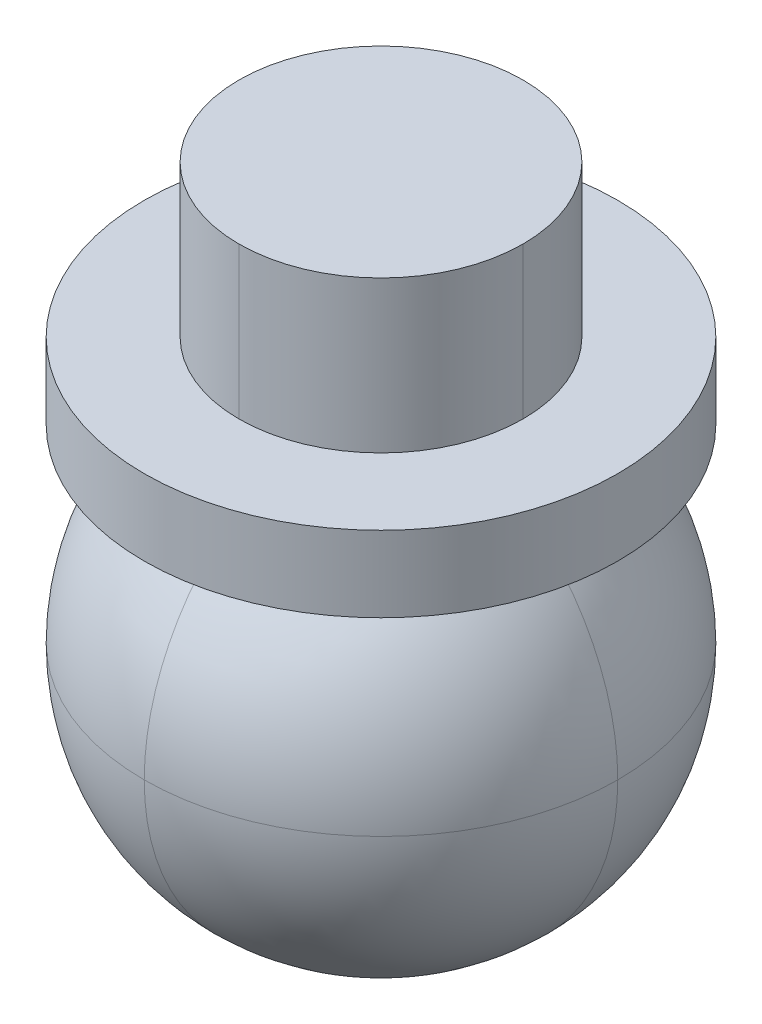
ISO-10303-21;
HEADER;
FILE_DESCRIPTION(('STEP AP214'),'2;1');
FILE_NAME('part.step','',(''),(''),'','','');
FILE_SCHEMA(('AUTOMOTIVE_DESIGN { 1 0 10303 214 1 1 1 1 }'));
ENDSEC;
DATA;
#1=APPLICATION_CONTEXT('core data for automotive mechanical design processes');
#2=APPLICATION_PROTOCOL_DEFINITION('international standard','automotive_design',2000,#1);
#3=PRODUCT_CONTEXT('',#1,'mechanical');
#4=PRODUCT('Part','Part','',(#3));
#5=PRODUCT_RELATED_PRODUCT_CATEGORY('part','',(#4));
#6=PRODUCT_DEFINITION_FORMATION('','',#4);
#7=PRODUCT_DEFINITION_CONTEXT('part definition',#1,'design');
#8=PRODUCT_DEFINITION('design','',#6,#7);
#9=PRODUCT_DEFINITION_SHAPE('','',#8);
#10=(LENGTH_UNIT() NAMED_UNIT(*) SI_UNIT(.MILLI.,.METRE.));
#11=(NAMED_UNIT(*) PLANE_ANGLE_UNIT() SI_UNIT($,.RADIAN.));
#12=(NAMED_UNIT(*) SI_UNIT($,.STERADIAN.) SOLID_ANGLE_UNIT());
#13=UNCERTAINTY_MEASURE_WITH_UNIT(LENGTH_MEASURE(1.E-05),#10,'distance_accuracy_value','');
#14=(GEOMETRIC_REPRESENTATION_CONTEXT(3) GLOBAL_UNCERTAINTY_ASSIGNED_CONTEXT((#13)) GLOBAL_UNIT_ASSIGNED_CONTEXT((#10,
#11,#12)) REPRESENTATION_CONTEXT('',''));
#15=CARTESIAN_POINT('',(0.,0.,0.));
#16=DIRECTION('',(0.,0.,1.));
#17=DIRECTION('',(1.,0.,0.));
#18=AXIS2_PLACEMENT_3D('',#15,#16,#17);
#19=CARTESIAN_POINT('',(-8.,2.5,0.));
#20=DIRECTION('',(0.,-1.,0.));
#21=DIRECTION('',(0.,0.,-1.));
#22=AXIS2_PLACEMENT_3D('',#19,#20,#21);
#23=SPHERICAL_SURFACE('',#22,2.5);
#24=CARTESIAN_POINT('',(-8.00000000000001,4.5,0.));
#25=DIRECTION('',(0.,-1.,0.));
#26=DIRECTION('',(0.,0.,-1.));
#27=AXIS2_PLACEMENT_3D('',#24,#25,#26);
#28=CIRCLE('',#27,1.5);
#29=CARTESIAN_POINT('',(-9.50000000000001,4.5,0.));
#30=VERTEX_POINT('',#29);
#31=CARTESIAN_POINT('',(-8.,4.5,1.5));
#32=VERTEX_POINT('',#31);
#33=EDGE_CURVE('E207',#30,#32,#28,.F.);
#34=ORIENTED_EDGE('',*,*,#33,.F.);
#35=CARTESIAN_POINT('',(-8.,2.5,0.));
#36=DIRECTION('',(0.,0.,-1.));
#37=DIRECTION('',(-1.,0.,0.));
#38=AXIS2_PLACEMENT_3D('',#35,#36,#37);
#39=CIRCLE('',#38,2.5);
#40=CARTESIAN_POINT('',(-10.5,2.5,0.));
#41=VERTEX_POINT('',#40);
#42=EDGE_CURVE('E240',#41,#30,#39,.T.);
#43=ORIENTED_EDGE('',*,*,#42,.F.);
#44=CARTESIAN_POINT('',(-8.,2.5,0.));
#45=DIRECTION('',(0.,-1.,0.));
#46=DIRECTION('',(0.,0.,-1.));
#47=AXIS2_PLACEMENT_3D('',#44,#45,#46);
#48=CIRCLE('',#47,2.5);
#49=CARTESIAN_POINT('',(-8.,2.5,2.5));
#50=VERTEX_POINT('',#49);
#51=EDGE_CURVE('E237',#50,#41,#48,.T.);
#52=ORIENTED_EDGE('',*,*,#51,.F.);
#53=CARTESIAN_POINT('',(-8.,2.5,0.));
#54=DIRECTION('',(1.,0.,0.));
#55=DIRECTION('',(0.,0.,-1.));
#56=AXIS2_PLACEMENT_3D('',#53,#54,#55);
#57=CIRCLE('',#56,2.5);
#58=EDGE_CURVE('E235',#32,#50,#57,.T.);
#59=ORIENTED_EDGE('',*,*,#58,.F.);
#60=EDGE_LOOP('',(#34,#43,#52,#59));
#61=FACE_BOUND('',#60,.T.);
#62=ADVANCED_FACE('F97',(#61),#23,.T.);
#63=CARTESIAN_POINT('',(-8.,2.5,0.));
#64=DIRECTION('',(0.,-1.,0.));
#65=DIRECTION('',(0.,0.,-1.));
#66=AXIS2_PLACEMENT_3D('',#63,#64,#65);
#67=SPHERICAL_SURFACE('',#66,2.5);
#68=CARTESIAN_POINT('',(-8.00000000000001,4.5,0.));
#69=DIRECTION('',(0.,-1.,0.));
#70=DIRECTION('',(0.,0.,-1.));
#71=AXIS2_PLACEMENT_3D('',#68,#69,#70);
#72=CIRCLE('',#71,1.5);
#73=CARTESIAN_POINT('',(-8.00000000000001,4.5,-1.5));
#74=VERTEX_POINT('',#73);
#75=EDGE_CURVE('E173',#74,#30,#72,.F.);
#76=ORIENTED_EDGE('',*,*,#75,.F.);
#77=CARTESIAN_POINT('',(-8.,2.5,0.));
#78=DIRECTION('',(1.,0.,0.));
#79=DIRECTION('',(0.,0.,-1.));
#80=AXIS2_PLACEMENT_3D('',#77,#78,#79);
#81=CIRCLE('',#80,2.5);
#82=CARTESIAN_POINT('',(-8.,2.5,-2.5));
#83=VERTEX_POINT('',#82);
#84=EDGE_CURVE('E231',#83,#74,#81,.T.);
#85=ORIENTED_EDGE('',*,*,#84,.F.);
#86=CARTESIAN_POINT('',(-8.,2.5,0.));
#87=DIRECTION('',(0.,-1.,0.));
#88=DIRECTION('',(0.,0.,-1.));
#89=AXIS2_PLACEMENT_3D('',#86,#87,#88);
#90=CIRCLE('',#89,2.5);
#91=EDGE_CURVE('E228',#41,#83,#90,.T.);
#92=ORIENTED_EDGE('',*,*,#91,.F.);
#93=ORIENTED_EDGE('',*,*,#42,.T.);
#94=EDGE_LOOP('',(#76,#85,#92,#93));
#95=FACE_BOUND('',#94,.T.);
#96=ADVANCED_FACE('F268',(#95),#67,.T.);
#97=CARTESIAN_POINT('',(-8.,2.5,0.));
#98=DIRECTION('',(0.,-1.,0.));
#99=DIRECTION('',(0.,0.,-1.));
#100=AXIS2_PLACEMENT_3D('',#97,#98,#99);
#101=SPHERICAL_SURFACE('',#100,2.5);
#102=CARTESIAN_POINT('',(-8.,2.5,0.));
#103=DIRECTION('',(1.,0.,0.));
#104=DIRECTION('',(0.,0.,-1.));
#105=AXIS2_PLACEMENT_3D('',#102,#103,#104);
#106=CIRCLE('',#105,2.5);
#107=CARTESIAN_POINT('',(-8.,0.,0.));
#108=VERTEX_POINT('',#107);
#109=EDGE_CURVE('E222',#50,#108,#106,.T.);
#110=ORIENTED_EDGE('',*,*,#109,.F.);
#111=ORIENTED_EDGE('',*,*,#51,.T.);
#112=CARTESIAN_POINT('',(-8.,2.5,0.));
#113=DIRECTION('',(0.,0.,-1.));
#114=DIRECTION('',(-1.,0.,0.));
#115=AXIS2_PLACEMENT_3D('',#112,#113,#114);
#116=CIRCLE('',#115,2.5);
#117=EDGE_CURVE('E225',#108,#41,#116,.T.);
#118=ORIENTED_EDGE('',*,*,#117,.F.);
#119=EDGE_LOOP('',(#110,#111,#118));
#120=FACE_BOUND('',#119,.T.);
#121=ADVANCED_FACE('F274',(#120),#101,.T.);
#122=CARTESIAN_POINT('',(-8.,2.5,0.));
#123=DIRECTION('',(0.,-1.,0.));
#124=DIRECTION('',(0.,0.,-1.));
#125=AXIS2_PLACEMENT_3D('',#122,#123,#124);
#126=SPHERICAL_SURFACE('',#125,2.5);
#127=CARTESIAN_POINT('',(-8.00000000000001,4.5,0.));
#128=DIRECTION('',(0.,-1.,0.));
#129=DIRECTION('',(0.,0.,-1.));
#130=AXIS2_PLACEMENT_3D('',#127,#128,#129);
#131=CIRCLE('',#130,1.5);
#132=CARTESIAN_POINT('',(-6.50000000000001,4.5,0.));
#133=VERTEX_POINT('',#132);
#134=EDGE_CURVE('E204',#32,#133,#131,.F.);
#135=ORIENTED_EDGE('',*,*,#134,.F.);
#136=ORIENTED_EDGE('',*,*,#58,.T.);
#137=CARTESIAN_POINT('',(-8.,2.5,0.));
#138=DIRECTION('',(0.,-1.,0.));
#139=DIRECTION('',(0.,0.,-1.));
#140=AXIS2_PLACEMENT_3D('',#137,#138,#139);
#141=CIRCLE('',#140,2.5);
#142=CARTESIAN_POINT('',(-5.5,2.5,0.));
#143=VERTEX_POINT('',#142);
#144=EDGE_CURVE('E219',#143,#50,#141,.T.);
#145=ORIENTED_EDGE('',*,*,#144,.F.);
#146=CARTESIAN_POINT('',(-8.,2.5,0.));
#147=DIRECTION('',(0.,0.,-1.));
#148=DIRECTION('',(-1.,0.,0.));
#149=AXIS2_PLACEMENT_3D('',#146,#147,#148);
#150=CIRCLE('',#149,2.5);
#151=EDGE_CURVE('E233',#133,#143,#150,.T.);
#152=ORIENTED_EDGE('',*,*,#151,.F.);
#153=EDGE_LOOP('',(#135,#136,#145,#152));
#154=FACE_BOUND('',#153,.T.);
#155=ADVANCED_FACE('F294',(#154),#126,.T.);
#156=CARTESIAN_POINT('',(-8.,2.5,0.));
#157=DIRECTION('',(0.,-1.,0.));
#158=DIRECTION('',(0.,0.,-1.));
#159=AXIS2_PLACEMENT_3D('',#156,#157,#158);
#160=SPHERICAL_SURFACE('',#159,2.5);
#161=CARTESIAN_POINT('',(-8.00000000000001,4.5,0.));
#162=DIRECTION('',(0.,-1.,0.));
#163=DIRECTION('',(0.,0.,-1.));
#164=AXIS2_PLACEMENT_3D('',#161,#162,#163);
#165=CIRCLE('',#164,1.5);
#166=EDGE_CURVE('E242',#133,#74,#165,.F.);
#167=ORIENTED_EDGE('',*,*,#166,.F.);
#168=ORIENTED_EDGE('',*,*,#151,.T.);
#169=CARTESIAN_POINT('',(-8.,2.5,0.));
#170=DIRECTION('',(0.,-1.,0.));
#171=DIRECTION('',(0.,0.,-1.));
#172=AXIS2_PLACEMENT_3D('',#169,#170,#171);
#173=CIRCLE('',#172,2.5);
#174=EDGE_CURVE('E216',#83,#143,#173,.T.);
#175=ORIENTED_EDGE('',*,*,#174,.F.);
#176=ORIENTED_EDGE('',*,*,#84,.T.);
#177=EDGE_LOOP('',(#167,#168,#175,#176));
#178=FACE_BOUND('',#177,.T.);
#179=ADVANCED_FACE('F297',(#178),#160,.T.);
#180=CARTESIAN_POINT('',(-8.,2.5,0.));
#181=DIRECTION('',(0.,-1.,0.));
#182=DIRECTION('',(0.,0.,-1.));
#183=AXIS2_PLACEMENT_3D('',#180,#181,#182);
#184=SPHERICAL_SURFACE('',#183,2.5);
#185=ORIENTED_EDGE('',*,*,#117,.T.);
#186=ORIENTED_EDGE('',*,*,#91,.T.);
#187=CARTESIAN_POINT('',(-8.,2.5,0.));
#188=DIRECTION('',(1.,0.,0.));
#189=DIRECTION('',(0.,0.,-1.));
#190=AXIS2_PLACEMENT_3D('',#187,#188,#189);
#191=CIRCLE('',#190,2.5);
#192=EDGE_CURVE('E213',#108,#83,#191,.T.);
#193=ORIENTED_EDGE('',*,*,#192,.F.);
#194=EDGE_LOOP('',(#185,#186,#193));
#195=FACE_BOUND('',#194,.T.);
#196=ADVANCED_FACE('F285',(#195),#184,.T.);
#197=CARTESIAN_POINT('',(-8.,2.5,0.));
#198=DIRECTION('',(0.,-1.,0.));
#199=DIRECTION('',(0.,0.,-1.));
#200=AXIS2_PLACEMENT_3D('',#197,#198,#199);
#201=SPHERICAL_SURFACE('',#200,2.5);
#202=ORIENTED_EDGE('',*,*,#144,.T.);
#203=ORIENTED_EDGE('',*,*,#109,.T.);
#204=CARTESIAN_POINT('',(-8.,2.5,0.));
#205=DIRECTION('',(0.,0.,-1.));
#206=DIRECTION('',(-1.,0.,0.));
#207=AXIS2_PLACEMENT_3D('',#204,#205,#206);
#208=CIRCLE('',#207,2.5);
#209=EDGE_CURVE('E210',#143,#108,#208,.T.);
#210=ORIENTED_EDGE('',*,*,#209,.F.);
#211=EDGE_LOOP('',(#202,#203,#210));
#212=FACE_BOUND('',#211,.T.);
#213=ADVANCED_FACE('F290',(#212),#201,.T.);
#214=CARTESIAN_POINT('',(-8.,2.5,0.));
#215=DIRECTION('',(0.,-1.,0.));
#216=DIRECTION('',(0.,0.,-1.));
#217=AXIS2_PLACEMENT_3D('',#214,#215,#216);
#218=SPHERICAL_SURFACE('',#217,2.5);
#219=ORIENTED_EDGE('',*,*,#192,.T.);
#220=ORIENTED_EDGE('',*,*,#174,.T.);
#221=ORIENTED_EDGE('',*,*,#209,.T.);
#222=EDGE_LOOP('',(#219,#220,#221));
#223=FACE_BOUND('',#222,.T.);
#224=ADVANCED_FACE('F263',(#223),#218,.T.);
#225=CARTESIAN_POINT('',(-8.,4.5,0.));
#226=DIRECTION('',(0.,1.,0.));
#227=DIRECTION('',(0.,0.,1.));
#228=AXIS2_PLACEMENT_3D('',#225,#226,#227);
#229=PLANE('',#228);
#230=ORIENTED_EDGE('',*,*,#134,.T.);
#231=ORIENTED_EDGE('',*,*,#166,.T.);
#232=ORIENTED_EDGE('',*,*,#75,.T.);
#233=ORIENTED_EDGE('',*,*,#33,.T.);
#234=EDGE_LOOP('',(#230,#231,#232,#233));
#235=FACE_BOUND('',#234,.T.);
#236=CARTESIAN_POINT('',(-8.,4.5,0.));
#237=DIRECTION('',(0.,-1.,0.));
#238=DIRECTION('',(0.,0.,-1.));
#239=AXIS2_PLACEMENT_3D('',#236,#237,#238);
#240=CIRCLE('',#239,2.5);
#241=CARTESIAN_POINT('',(-8.,4.5,-2.5));
#242=VERTEX_POINT('',#241);
#243=EDGE_CURVE('E189',#242,#242,#240,.T.);
#244=ORIENTED_EDGE('',*,*,#243,.T.);
#245=EDGE_LOOP('',(#244));
#246=FACE_BOUND('',#245,.T.);
#247=ADVANCED_FACE('F257',(#235,#246),#229,.F.);
#248=CARTESIAN_POINT('',(-8.,0.,0.));
#249=DIRECTION('',(0.,-1.,0.));
#250=DIRECTION('',(0.,0.,-1.));
#251=AXIS2_PLACEMENT_3D('',#248,#249,#250);
#252=CYLINDRICAL_SURFACE('',#251,2.5);
#253=ORIENTED_EDGE('',*,*,#243,.F.);
#254=EDGE_LOOP('',(#253));
#255=FACE_BOUND('',#254,.T.);
#256=CARTESIAN_POINT('',(-8.,5.3,0.));
#257=DIRECTION('',(0.,-1.,0.));
#258=DIRECTION('',(0.,0.,-1.));
#259=AXIS2_PLACEMENT_3D('',#256,#257,#258);
#260=CIRCLE('',#259,2.5);
#261=CARTESIAN_POINT('',(-8.,5.3,-2.5));
#262=VERTEX_POINT('',#261);
#263=EDGE_CURVE('E184',#262,#262,#260,.T.);
#264=ORIENTED_EDGE('',*,*,#263,.T.);
#265=EDGE_LOOP('',(#264));
#266=FACE_BOUND('',#265,.T.);
#267=ADVANCED_FACE('F252',(#255,#266),#252,.T.);
#268=CARTESIAN_POINT('',(-10.5,5.3,0.));
#269=DIRECTION('',(0.,-1.,0.));
#270=DIRECTION('',(0.,0.,-1.));
#271=AXIS2_PLACEMENT_3D('',#268,#269,#270);
#272=PLANE('',#271);
#273=CARTESIAN_POINT('',(-8.00000000000001,5.3,0.));
#274=DIRECTION('',(0.,-1.,0.));
#275=DIRECTION('',(0.,0.,-1.));
#276=AXIS2_PLACEMENT_3D('',#273,#274,#275);
#277=CIRCLE('',#276,1.5);
#278=CARTESIAN_POINT('',(-8.00000000000001,5.3,1.5));
#279=VERTEX_POINT('',#278);
#280=CARTESIAN_POINT('',(-6.50000000000001,5.3,0.));
#281=VERTEX_POINT('',#280);
#282=EDGE_CURVE('E169',#279,#281,#277,.F.);
#283=ORIENTED_EDGE('',*,*,#282,.F.);
#284=CARTESIAN_POINT('',(-8.00000000000001,5.3,0.));
#285=DIRECTION('',(0.,-1.,0.));
#286=DIRECTION('',(0.,0.,-1.));
#287=AXIS2_PLACEMENT_3D('',#284,#285,#286);
#288=CIRCLE('',#287,1.5);
#289=CARTESIAN_POINT('',(-9.50000000000001,5.3,0.));
#290=VERTEX_POINT('',#289);
#291=EDGE_CURVE('E192',#290,#279,#288,.F.);
#292=ORIENTED_EDGE('',*,*,#291,.F.);
#293=CARTESIAN_POINT('',(-8.00000000000001,5.3,0.));
#294=DIRECTION('',(0.,-1.,0.));
#295=DIRECTION('',(0.,0.,-1.));
#296=AXIS2_PLACEMENT_3D('',#293,#294,#295);
#297=CIRCLE('',#296,1.5);
#298=CARTESIAN_POINT('',(-8.00000000000001,5.3,-1.5));
#299=VERTEX_POINT('',#298);
#300=EDGE_CURVE('E104',#299,#290,#297,.F.);
#301=ORIENTED_EDGE('',*,*,#300,.F.);
#302=CARTESIAN_POINT('',(-8.00000000000001,5.3,0.));
#303=DIRECTION('',(0.,-1.,0.));
#304=DIRECTION('',(0.,0.,-1.));
#305=AXIS2_PLACEMENT_3D('',#302,#303,#304);
#306=CIRCLE('',#305,1.5);
#307=EDGE_CURVE('E195',#281,#299,#306,.F.);
#308=ORIENTED_EDGE('',*,*,#307,.F.);
#309=EDGE_LOOP('',(#283,#292,#301,#308));
#310=FACE_BOUND('',#309,.T.);
#311=ORIENTED_EDGE('',*,*,#263,.F.);
#312=EDGE_LOOP('',(#311));
#313=FACE_BOUND('',#312,.T.);
#314=ADVANCED_FACE('F249',(#310,#313),#272,.F.);
#315=CARTESIAN_POINT('',(-8.00000000000001,2.8729861543631,0.));
#316=DIRECTION('',(0.,1.,0.));
#317=DIRECTION('',(0.,0.,1.));
#318=AXIS2_PLACEMENT_3D('',#315,#316,#317);
#319=CYLINDRICAL_SURFACE('',#318,1.5);
#320=CARTESIAN_POINT('',(-8.00000000000001,6.9,0.));
#321=DIRECTION('',(0.,-1.,0.));
#322=DIRECTION('',(0.,0.,-1.));
#323=AXIS2_PLACEMENT_3D('',#320,#321,#322);
#324=CIRCLE('',#323,1.5);
#325=CARTESIAN_POINT('',(-8.00000000000001,6.9,-1.5));
#326=VERTEX_POINT('',#325);
#327=CARTESIAN_POINT('',(-9.50000000000001,6.9,0.));
#328=VERTEX_POINT('',#327);
#329=EDGE_CURVE('E118',#326,#328,#324,.F.);
#330=ORIENTED_EDGE('',*,*,#329,.F.);
#331=DIRECTION('',(0.,1.,0.));
#332=VECTOR('',#331,1.);
#333=CARTESIAN_POINT('',(-8.00000000000001,2.8729861543631,-1.5));
#334=LINE('',#333,#332);
#335=EDGE_CURVE('E179',#326,#299,#334,.F.);
#336=ORIENTED_EDGE('',*,*,#335,.T.);
#337=ORIENTED_EDGE('',*,*,#300,.T.);
#338=DIRECTION('',(0.,-1.,0.));
#339=VECTOR('',#338,1.);
#340=CARTESIAN_POINT('',(-9.50000000000001,2.8729861543631,0.));
#341=LINE('',#340,#339);
#342=EDGE_CURVE('E198',#290,#328,#341,.F.);
#343=ORIENTED_EDGE('',*,*,#342,.T.);
#344=EDGE_LOOP('',(#330,#336,#337,#343));
#345=FACE_BOUND('',#344,.T.);
#346=ADVANCED_FACE('F246',(#345),#319,.T.);
#347=CARTESIAN_POINT('',(-8.00000000000001,0.,0.));
#348=DIRECTION('',(0.,-1.,0.));
#349=DIRECTION('',(0.,0.,-1.));
#350=AXIS2_PLACEMENT_3D('',#347,#348,#349);
#351=CYLINDRICAL_SURFACE('',#350,1.5);
#352=CARTESIAN_POINT('',(-8.00000000000001,6.9,0.));
#353=DIRECTION('',(0.,-1.,0.));
#354=DIRECTION('',(0.,0.,-1.));
#355=AXIS2_PLACEMENT_3D('',#352,#353,#354);
#356=CIRCLE('',#355,1.5);
#357=CARTESIAN_POINT('',(-8.00000000000001,6.9,1.5));
#358=VERTEX_POINT('',#357);
#359=EDGE_CURVE('E111',#328,#358,#356,.F.);
#360=ORIENTED_EDGE('',*,*,#359,.F.);
#361=ORIENTED_EDGE('',*,*,#342,.F.);
#362=ORIENTED_EDGE('',*,*,#291,.T.);
#363=DIRECTION('',(0.,1.,0.));
#364=VECTOR('',#363,1.);
#365=CARTESIAN_POINT('',(-8.00000000000001,0.,1.5));
#366=LINE('',#365,#364);
#367=EDGE_CURVE('E174',#279,#358,#366,.T.);
#368=ORIENTED_EDGE('',*,*,#367,.T.);
#369=EDGE_LOOP('',(#360,#361,#362,#368));
#370=FACE_BOUND('',#369,.T.);
#371=ADVANCED_FACE('F248',(#370),#351,.T.);
#372=CARTESIAN_POINT('',(-8.00000000000001,2.8729861543631,0.));
#373=DIRECTION('',(0.,-1.,0.));
#374=DIRECTION('',(1.,0.,0.));
#375=AXIS2_PLACEMENT_3D('',#372,#373,#374);
#376=CYLINDRICAL_SURFACE('',#375,1.5);
#377=CARTESIAN_POINT('',(-8.00000000000001,6.9,0.));
#378=DIRECTION('',(0.,-1.,0.));
#379=DIRECTION('',(0.,0.,-1.));
#380=AXIS2_PLACEMENT_3D('',#377,#378,#379);
#381=CIRCLE('',#380,1.5);
#382=CARTESIAN_POINT('',(-6.50000000000001,6.9,0.));
#383=VERTEX_POINT('',#382);
#384=EDGE_CURVE('E177',#383,#326,#381,.F.);
#385=ORIENTED_EDGE('',*,*,#384,.F.);
#386=DIRECTION('',(0.,1.,0.));
#387=VECTOR('',#386,1.);
#388=CARTESIAN_POINT('',(-6.50000000000001,2.8729861543631,0.));
#389=LINE('',#388,#387);
#390=EDGE_CURVE('E165',#383,#281,#389,.F.);
#391=ORIENTED_EDGE('',*,*,#390,.T.);
#392=ORIENTED_EDGE('',*,*,#307,.T.);
#393=ORIENTED_EDGE('',*,*,#335,.F.);
#394=EDGE_LOOP('',(#385,#391,#392,#393));
#395=FACE_BOUND('',#394,.T.);
#396=ADVANCED_FACE('F178',(#395),#376,.T.);
#397=CARTESIAN_POINT('',(-8.00000000000001,0.,0.));
#398=DIRECTION('',(0.,1.,0.));
#399=DIRECTION('',(-1.,0.,0.));
#400=AXIS2_PLACEMENT_3D('',#397,#398,#399);
#401=CYLINDRICAL_SURFACE('',#400,1.5);
#402=CARTESIAN_POINT('',(-8.00000000000001,6.9,0.));
#403=DIRECTION('',(0.,-1.,0.));
#404=DIRECTION('',(0.,0.,-1.));
#405=AXIS2_PLACEMENT_3D('',#402,#403,#404);
#406=CIRCLE('',#405,1.5);
#407=EDGE_CURVE('E53',#358,#383,#406,.F.);
#408=ORIENTED_EDGE('',*,*,#407,.F.);
#409=ORIENTED_EDGE('',*,*,#367,.F.);
#410=ORIENTED_EDGE('',*,*,#282,.T.);
#411=ORIENTED_EDGE('',*,*,#390,.F.);
#412=EDGE_LOOP('',(#408,#409,#410,#411));
#413=FACE_BOUND('',#412,.T.);
#414=ADVANCED_FACE('F167',(#413),#401,.T.);
#415=CARTESIAN_POINT('',(-10.1663770413039,6.9,-5.));
#416=DIRECTION('',(0.,-1.,0.));
#417=DIRECTION('',(0.,0.,-1.));
#418=AXIS2_PLACEMENT_3D('',#415,#416,#417);
#419=PLANE('',#418);
#420=ORIENTED_EDGE('',*,*,#384,.T.);
#421=ORIENTED_EDGE('',*,*,#329,.T.);
#422=ORIENTED_EDGE('',*,*,#359,.T.);
#423=ORIENTED_EDGE('',*,*,#407,.T.);
#424=EDGE_LOOP('',(#420,#421,#422,#423));
#425=FACE_BOUND('',#424,.T.);
#426=ADVANCED_FACE('F182',(#425),#419,.F.);
#427=CLOSED_SHELL('',(#62,#96,#121,#155,#179,#196,#213,#224,#247,#267,#314,#346,#371,#396,#414,#426));
#428=MANIFOLD_SOLID_BREP('B6',#427);
#429=ADVANCED_BREP_SHAPE_REPRESENTATION('',(#18,#428),#14);
#430=SHAPE_DEFINITION_REPRESENTATION(#9,#429);
ENDSEC;
END-ISO-10303-21;
